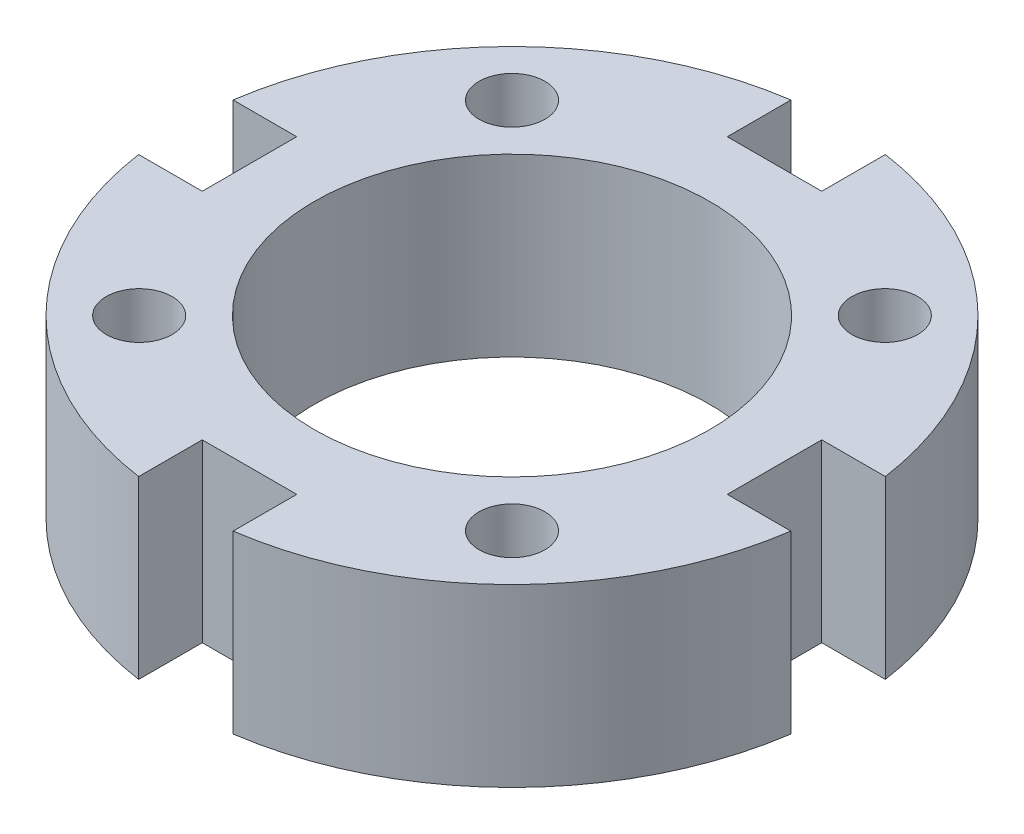
ISO-10303-21;
HEADER;
FILE_DESCRIPTION(('STEP AP214'),'2;1');
FILE_NAME('part.step','',(''),(''),'','','');
FILE_SCHEMA(('AUTOMOTIVE_DESIGN { 1 0 10303 214 1 1 1 1 }'));
ENDSEC;
DATA;
#1=APPLICATION_CONTEXT('core data for automotive mechanical design processes');
#2=APPLICATION_PROTOCOL_DEFINITION('international standard','automotive_design',2000,#1);
#3=PRODUCT_CONTEXT('',#1,'mechanical');
#4=PRODUCT('Part','Part','',(#3));
#5=PRODUCT_RELATED_PRODUCT_CATEGORY('part','',(#4));
#6=PRODUCT_DEFINITION_FORMATION('','',#4);
#7=PRODUCT_DEFINITION_CONTEXT('part definition',#1,'design');
#8=PRODUCT_DEFINITION('design','',#6,#7);
#9=PRODUCT_DEFINITION_SHAPE('','',#8);
#10=(LENGTH_UNIT() NAMED_UNIT(*) SI_UNIT(.MILLI.,.METRE.));
#11=(NAMED_UNIT(*) PLANE_ANGLE_UNIT() SI_UNIT($,.RADIAN.));
#12=(NAMED_UNIT(*) SI_UNIT($,.STERADIAN.) SOLID_ANGLE_UNIT());
#13=UNCERTAINTY_MEASURE_WITH_UNIT(LENGTH_MEASURE(1.E-05),#10,'distance_accuracy_value','');
#14=(GEOMETRIC_REPRESENTATION_CONTEXT(3) GLOBAL_UNCERTAINTY_ASSIGNED_CONTEXT((#13)) GLOBAL_UNIT_ASSIGNED_CONTEXT((#10,
#11,#12)) REPRESENTATION_CONTEXT('',''));
#15=CARTESIAN_POINT('',(0.,0.,0.));
#16=DIRECTION('',(0.,0.,1.));
#17=DIRECTION('',(1.,0.,0.));
#18=AXIS2_PLACEMENT_3D('',#15,#16,#17);
#19=CARTESIAN_POINT('',(0.,4.,0.));
#20=DIRECTION('',(0.,1.,0.));
#21=DIRECTION('',(0.,0.,1.));
#22=AXIS2_PLACEMENT_3D('',#19,#20,#21);
#23=PLANE('',#22);
#24=CARTESIAN_POINT('',(4.24264068711925,4.,-4.24264068711932));
#25=DIRECTION('',(0.,-1.,0.));
#26=DIRECTION('',(-1.,0.,0.));
#27=AXIS2_PLACEMENT_3D('',#24,#25,#26);
#28=CIRCLE('',#27,0.749999999999997);
#29=CARTESIAN_POINT('',(3.49264068711925,4.,-4.24264068711932));
#30=VERTEX_POINT('',#29);
#31=EDGE_CURVE('E382',#30,#30,#28,.T.);
#32=ORIENTED_EDGE('',*,*,#31,.T.);
#33=EDGE_LOOP('',(#32));
#34=FACE_BOUND('',#33,.T.);
#35=CARTESIAN_POINT('',(-4.24264068711931,4.,-4.24264068711926));
#36=DIRECTION('',(0.,-1.,0.));
#37=DIRECTION('',(0.,0.,1.));
#38=AXIS2_PLACEMENT_3D('',#35,#36,#37);
#39=CIRCLE('',#38,0.749999999999997);
#40=CARTESIAN_POINT('',(-4.24264068711931,4.,-3.49264068711927));
#41=VERTEX_POINT('',#40);
#42=EDGE_CURVE('E386',#41,#41,#39,.T.);
#43=ORIENTED_EDGE('',*,*,#42,.T.);
#44=EDGE_LOOP('',(#43));
#45=FACE_BOUND('',#44,.T.);
#46=CARTESIAN_POINT('',(-4.24264068711922,4.,4.24264068711935));
#47=DIRECTION('',(0.,-1.,0.));
#48=DIRECTION('',(1.,0.,0.));
#49=AXIS2_PLACEMENT_3D('',#46,#47,#48);
#50=CIRCLE('',#49,0.749999999999997);
#51=CARTESIAN_POINT('',(-3.49264068711922,4.,4.24264068711934));
#52=VERTEX_POINT('',#51);
#53=EDGE_CURVE('E396',#52,#52,#50,.T.);
#54=ORIENTED_EDGE('',*,*,#53,.T.);
#55=EDGE_LOOP('',(#54));
#56=FACE_BOUND('',#55,.T.);
#57=CARTESIAN_POINT('',(4.24264068711931,4.,4.24264068711926));
#58=DIRECTION('',(0.,-1.,0.));
#59=DIRECTION('',(0.,0.,-1.));
#60=AXIS2_PLACEMENT_3D('',#57,#58,#59);
#61=CIRCLE('',#60,0.749999999999997);
#62=CARTESIAN_POINT('',(4.24264068711931,4.,3.49264068711927));
#63=VERTEX_POINT('',#62);
#64=EDGE_CURVE('E216',#63,#63,#61,.T.);
#65=ORIENTED_EDGE('',*,*,#64,.T.);
#66=EDGE_LOOP('',(#65));
#67=FACE_BOUND('',#66,.T.);
#68=CARTESIAN_POINT('',(0.,4.,0.));
#69=DIRECTION('',(0.,1.,0.));
#70=DIRECTION('',(0.,0.,1.));
#71=AXIS2_PLACEMENT_3D('',#68,#69,#70);
#72=CIRCLE('',#71,4.5);
#73=CARTESIAN_POINT('',(0.,4.,4.5));
#74=VERTEX_POINT('',#73);
#75=EDGE_CURVE('E246',#74,#74,#72,.T.);
#76=ORIENTED_EDGE('',*,*,#75,.F.);
#77=EDGE_LOOP('',(#76));
#78=FACE_BOUND('',#77,.T.);
#79=CARTESIAN_POINT('',(0.,4.,0.));
#80=DIRECTION('',(0.,1.,0.));
#81=DIRECTION('',(0.,0.,1.));
#82=AXIS2_PLACEMENT_3D('',#79,#80,#81);
#83=CIRCLE('',#82,7.5);
#84=CARTESIAN_POINT('',(1.075,4.,7.42255852115697));
#85=VERTEX_POINT('',#84);
#86=CARTESIAN_POINT('',(7.42255852115698,4.,1.07499999999997));
#87=VERTEX_POINT('',#86);
#88=EDGE_CURVE('E252',#85,#87,#83,.T.);
#89=ORIENTED_EDGE('',*,*,#88,.T.);
#90=DIRECTION('',(1.,0.,0.));
#91=VECTOR('',#90,1.);
#92=CARTESIAN_POINT('',(5.97499999997551,4.,1.07499999999998));
#93=LINE('',#92,#91);
#94=CARTESIAN_POINT('',(5.97499999997551,4.,1.07499999999998));
#95=VERTEX_POINT('',#94);
#96=EDGE_CURVE('E173',#95,#87,#93,.T.);
#97=ORIENTED_EDGE('',*,*,#96,.F.);
#98=DIRECTION('',(0.,0.,-1.));
#99=VECTOR('',#98,1.);
#100=CARTESIAN_POINT('',(5.97499999997551,4.,1.07499999999998));
#101=LINE('',#100,#99);
#102=CARTESIAN_POINT('',(5.9749999999755,4.,-1.07500000000002));
#103=VERTEX_POINT('',#102);
#104=EDGE_CURVE('E172',#95,#103,#101,.T.);
#105=ORIENTED_EDGE('',*,*,#104,.T.);
#106=DIRECTION('',(1.,0.,0.));
#107=VECTOR('',#106,1.);
#108=CARTESIAN_POINT('',(5.9749999999755,4.,-1.07500000000002));
#109=LINE('',#108,#107);
#110=CARTESIAN_POINT('',(7.42255852115697,4.,-1.07500000000003));
#111=VERTEX_POINT('',#110);
#112=EDGE_CURVE('E164',#103,#111,#109,.T.);
#113=ORIENTED_EDGE('',*,*,#112,.T.);
#114=CARTESIAN_POINT('',(1.075,4.,-7.42255852115697));
#115=VERTEX_POINT('',#114);
#116=EDGE_CURVE('E256',#111,#115,#83,.T.);
#117=ORIENTED_EDGE('',*,*,#116,.T.);
#118=DIRECTION('',(0.,0.,-1.));
#119=VECTOR('',#118,1.);
#120=CARTESIAN_POINT('',(1.075,4.,-5.97499999997551));
#121=LINE('',#120,#119);
#122=CARTESIAN_POINT('',(1.075,4.,-5.97499999997551));
#123=VERTEX_POINT('',#122);
#124=EDGE_CURVE('E191',#123,#115,#121,.T.);
#125=ORIENTED_EDGE('',*,*,#124,.F.);
#126=DIRECTION('',(-1.,0.,0.));
#127=VECTOR('',#126,1.);
#128=CARTESIAN_POINT('',(1.075,4.,-5.97499999997551));
#129=LINE('',#128,#127);
#130=CARTESIAN_POINT('',(-1.075,4.,-5.97499999997551));
#131=VERTEX_POINT('',#130);
#132=EDGE_CURVE('E201',#123,#131,#129,.T.);
#133=ORIENTED_EDGE('',*,*,#132,.T.);
#134=DIRECTION('',(0.,0.,-1.));
#135=VECTOR('',#134,1.);
#136=CARTESIAN_POINT('',(-1.075,4.,-5.97499999997551));
#137=LINE('',#136,#135);
#138=CARTESIAN_POINT('',(-1.075,4.,-7.42255852115697));
#139=VERTEX_POINT('',#138);
#140=EDGE_CURVE('E188',#131,#139,#137,.T.);
#141=ORIENTED_EDGE('',*,*,#140,.T.);
#142=CARTESIAN_POINT('',(-7.42255852115698,4.,-1.07499999999992));
#143=VERTEX_POINT('',#142);
#144=EDGE_CURVE('E409',#139,#143,#83,.T.);
#145=ORIENTED_EDGE('',*,*,#144,.T.);
#146=DIRECTION('',(-1.,0.,0.));
#147=VECTOR('',#146,1.);
#148=CARTESIAN_POINT('',(-5.97499999997552,4.,-1.07499999999994));
#149=LINE('',#148,#147);
#150=CARTESIAN_POINT('',(-5.97499999997552,4.,-1.07499999999994));
#151=VERTEX_POINT('',#150);
#152=EDGE_CURVE('E211',#151,#143,#149,.T.);
#153=ORIENTED_EDGE('',*,*,#152,.F.);
#154=DIRECTION('',(0.,0.,1.));
#155=VECTOR('',#154,1.);
#156=CARTESIAN_POINT('',(-5.97499999997552,4.,-1.07499999999994));
#157=LINE('',#156,#155);
#158=CARTESIAN_POINT('',(-5.9749999999755,4.,1.07500000000006));
#159=VERTEX_POINT('',#158);
#160=EDGE_CURVE('E196',#151,#159,#157,.T.);
#161=ORIENTED_EDGE('',*,*,#160,.T.);
#162=DIRECTION('',(-1.,0.,0.));
#163=VECTOR('',#162,1.);
#164=CARTESIAN_POINT('',(-5.9749999999755,4.,1.07500000000006));
#165=LINE('',#164,#163);
#166=CARTESIAN_POINT('',(-7.42255852115696,4.,1.07500000000008));
#167=VERTEX_POINT('',#166);
#168=EDGE_CURVE('E208',#159,#167,#165,.T.);
#169=ORIENTED_EDGE('',*,*,#168,.T.);
#170=CARTESIAN_POINT('',(-1.075,4.,7.42255852115697));
#171=VERTEX_POINT('',#170);
#172=EDGE_CURVE('E257',#167,#171,#83,.T.);
#173=ORIENTED_EDGE('',*,*,#172,.T.);
#174=DIRECTION('',(0.,0.,1.));
#175=VECTOR('',#174,1.);
#176=CARTESIAN_POINT('',(-1.075,4.,5.97499999997551));
#177=LINE('',#176,#175);
#178=CARTESIAN_POINT('',(-1.075,4.,5.97499999997551));
#179=VERTEX_POINT('',#178);
#180=EDGE_CURVE('E230',#179,#171,#177,.T.);
#181=ORIENTED_EDGE('',*,*,#180,.F.);
#182=DIRECTION('',(1.,0.,0.));
#183=VECTOR('',#182,1.);
#184=CARTESIAN_POINT('',(-1.075,4.,5.97499999997551));
#185=LINE('',#184,#183);
#186=CARTESIAN_POINT('',(1.075,4.,5.97499999997551));
#187=VERTEX_POINT('',#186);
#188=EDGE_CURVE('E241',#179,#187,#185,.T.);
#189=ORIENTED_EDGE('',*,*,#188,.T.);
#190=DIRECTION('',(0.,0.,1.));
#191=VECTOR('',#190,1.);
#192=CARTESIAN_POINT('',(1.075,4.,5.97499999997551));
#193=LINE('',#192,#191);
#194=EDGE_CURVE('E227',#187,#85,#193,.T.);
#195=ORIENTED_EDGE('',*,*,#194,.T.);
#196=EDGE_LOOP('',(#89,#97,#105,#113,#117,#125,#133,#141,#145,#153,#161,#169,#173,#181,#189,#195));
#197=FACE_BOUND('',#196,.T.);
#198=ADVANCED_FACE('F40',(#34,#45,#56,#67,#78,#197),#23,.T.);
#199=CARTESIAN_POINT('',(0.,0.,0.));
#200=DIRECTION('',(0.,1.,0.));
#201=DIRECTION('',(0.,0.,1.));
#202=AXIS2_PLACEMENT_3D('',#199,#200,#201);
#203=PLANE('',#202);
#204=CARTESIAN_POINT('',(4.24264068711925,0.,-4.24264068711932));
#205=DIRECTION('',(0.,-1.,0.));
#206=DIRECTION('',(-1.,0.,0.));
#207=AXIS2_PLACEMENT_3D('',#204,#205,#206);
#208=CIRCLE('',#207,0.749999999999997);
#209=CARTESIAN_POINT('',(3.49264068711925,0.,-4.24264068711932));
#210=VERTEX_POINT('',#209);
#211=EDGE_CURVE('E385',#210,#210,#208,.T.);
#212=ORIENTED_EDGE('',*,*,#211,.F.);
#213=EDGE_LOOP('',(#212));
#214=FACE_BOUND('',#213,.T.);
#215=CARTESIAN_POINT('',(-4.24264068711931,0.,-4.24264068711926));
#216=DIRECTION('',(0.,-1.,0.));
#217=DIRECTION('',(0.,0.,1.));
#218=AXIS2_PLACEMENT_3D('',#215,#216,#217);
#219=CIRCLE('',#218,0.749999999999997);
#220=CARTESIAN_POINT('',(-4.24264068711931,0.,-3.49264068711927));
#221=VERTEX_POINT('',#220);
#222=EDGE_CURVE('E391',#221,#221,#219,.T.);
#223=ORIENTED_EDGE('',*,*,#222,.F.);
#224=EDGE_LOOP('',(#223));
#225=FACE_BOUND('',#224,.T.);
#226=CARTESIAN_POINT('',(-4.24264068711922,0.,4.24264068711935));
#227=DIRECTION('',(0.,-1.,0.));
#228=DIRECTION('',(1.,0.,0.));
#229=AXIS2_PLACEMENT_3D('',#226,#227,#228);
#230=CIRCLE('',#229,0.749999999999997);
#231=CARTESIAN_POINT('',(-3.49264068711922,0.,4.24264068711934));
#232=VERTEX_POINT('',#231);
#233=EDGE_CURVE('E399',#232,#232,#230,.T.);
#234=ORIENTED_EDGE('',*,*,#233,.F.);
#235=EDGE_LOOP('',(#234));
#236=FACE_BOUND('',#235,.T.);
#237=CARTESIAN_POINT('',(4.24264068711931,0.,4.24264068711926));
#238=DIRECTION('',(0.,-1.,0.));
#239=DIRECTION('',(0.,0.,-1.));
#240=AXIS2_PLACEMENT_3D('',#237,#238,#239);
#241=CIRCLE('',#240,0.749999999999997);
#242=CARTESIAN_POINT('',(4.24264068711931,0.,3.49264068711927));
#243=VERTEX_POINT('',#242);
#244=EDGE_CURVE('E388',#243,#243,#241,.T.);
#245=ORIENTED_EDGE('',*,*,#244,.F.);
#246=EDGE_LOOP('',(#245));
#247=FACE_BOUND('',#246,.T.);
#248=CARTESIAN_POINT('',(0.,0.,0.));
#249=DIRECTION('',(0.,1.,0.));
#250=DIRECTION('',(0.,0.,1.));
#251=AXIS2_PLACEMENT_3D('',#248,#249,#250);
#252=CIRCLE('',#251,4.5);
#253=CARTESIAN_POINT('',(0.,0.,4.5));
#254=VERTEX_POINT('',#253);
#255=EDGE_CURVE('E244',#254,#254,#252,.T.);
#256=ORIENTED_EDGE('',*,*,#255,.T.);
#257=EDGE_LOOP('',(#256));
#258=FACE_BOUND('',#257,.T.);
#259=DIRECTION('',(-1.,0.,0.));
#260=VECTOR('',#259,1.);
#261=CARTESIAN_POINT('',(7.49999999997551,0.,1.07499999999997));
#262=LINE('',#261,#260);
#263=CARTESIAN_POINT('',(7.42255852115698,0.,1.07499999999997));
#264=VERTEX_POINT('',#263);
#265=CARTESIAN_POINT('',(5.97499999997551,0.,1.07499999999998));
#266=VERTEX_POINT('',#265);
#267=EDGE_CURVE('E154',#264,#266,#262,.T.);
#268=ORIENTED_EDGE('',*,*,#267,.F.);
#269=CARTESIAN_POINT('',(0.,0.,0.));
#270=DIRECTION('',(0.,1.,0.));
#271=DIRECTION('',(0.,0.,1.));
#272=AXIS2_PLACEMENT_3D('',#269,#270,#271);
#273=CIRCLE('',#272,7.5);
#274=CARTESIAN_POINT('',(1.075,0.,7.42255852115697));
#275=VERTEX_POINT('',#274);
#276=EDGE_CURVE('E258',#275,#264,#273,.T.);
#277=ORIENTED_EDGE('',*,*,#276,.F.);
#278=DIRECTION('',(0.,0.,-1.));
#279=VECTOR('',#278,1.);
#280=CARTESIAN_POINT('',(1.075,0.,7.49999999997551));
#281=LINE('',#280,#279);
#282=CARTESIAN_POINT('',(1.075,0.,5.97499999997551));
#283=VERTEX_POINT('',#282);
#284=EDGE_CURVE('E180',#275,#283,#281,.T.);
#285=ORIENTED_EDGE('',*,*,#284,.T.);
#286=DIRECTION('',(1.,0.,0.));
#287=VECTOR('',#286,1.);
#288=CARTESIAN_POINT('',(-1.075,0.,5.97499999997551));
#289=LINE('',#288,#287);
#290=CARTESIAN_POINT('',(-1.075,0.,5.97499999997551));
#291=VERTEX_POINT('',#290);
#292=EDGE_CURVE('E233',#291,#283,#289,.T.);
#293=ORIENTED_EDGE('',*,*,#292,.F.);
#294=DIRECTION('',(0.,0.,-1.));
#295=VECTOR('',#294,1.);
#296=CARTESIAN_POINT('',(-1.075,0.,7.49999999997551));
#297=LINE('',#296,#295);
#298=CARTESIAN_POINT('',(-1.075,0.,7.42255852115697));
#299=VERTEX_POINT('',#298);
#300=EDGE_CURVE('E224',#299,#291,#297,.T.);
#301=ORIENTED_EDGE('',*,*,#300,.F.);
#302=CARTESIAN_POINT('',(-7.42255852115696,0.,1.07500000000008));
#303=VERTEX_POINT('',#302);
#304=EDGE_CURVE('E249',#303,#299,#273,.T.);
#305=ORIENTED_EDGE('',*,*,#304,.F.);
#306=DIRECTION('',(1.,0.,0.));
#307=VECTOR('',#306,1.);
#308=CARTESIAN_POINT('',(-7.4999999999755,0.,1.07500000000008));
#309=LINE('',#308,#307);
#310=CARTESIAN_POINT('',(-5.9749999999755,0.,1.07500000000006));
#311=VERTEX_POINT('',#310);
#312=EDGE_CURVE('E55',#303,#311,#309,.T.);
#313=ORIENTED_EDGE('',*,*,#312,.T.);
#314=DIRECTION('',(0.,0.,1.));
#315=VECTOR('',#314,1.);
#316=CARTESIAN_POINT('',(-5.97499999997552,0.,-1.07499999999994));
#317=LINE('',#316,#315);
#318=CARTESIAN_POINT('',(-5.97499999997552,0.,-1.07499999999994));
#319=VERTEX_POINT('',#318);
#320=EDGE_CURVE('E213',#319,#311,#317,.T.);
#321=ORIENTED_EDGE('',*,*,#320,.F.);
#322=DIRECTION('',(1.,0.,0.));
#323=VECTOR('',#322,1.);
#324=CARTESIAN_POINT('',(-7.49999999997552,0.,-1.07499999999992));
#325=LINE('',#324,#323);
#326=CARTESIAN_POINT('',(-7.42255852115698,0.,-1.07499999999992));
#327=VERTEX_POINT('',#326);
#328=EDGE_CURVE('E205',#327,#319,#325,.T.);
#329=ORIENTED_EDGE('',*,*,#328,.F.);
#330=CARTESIAN_POINT('',(-1.075,0.,-7.42255852115697));
#331=VERTEX_POINT('',#330);
#332=EDGE_CURVE('E284',#331,#327,#273,.T.);
#333=ORIENTED_EDGE('',*,*,#332,.F.);
#334=DIRECTION('',(0.,0.,1.));
#335=VECTOR('',#334,1.);
#336=CARTESIAN_POINT('',(-1.075,0.,-7.49999999997551));
#337=LINE('',#336,#335);
#338=CARTESIAN_POINT('',(-1.075,0.,-5.97499999997551));
#339=VERTEX_POINT('',#338);
#340=EDGE_CURVE('E63',#331,#339,#337,.T.);
#341=ORIENTED_EDGE('',*,*,#340,.T.);
#342=DIRECTION('',(-1.,0.,0.));
#343=VECTOR('',#342,1.);
#344=CARTESIAN_POINT('',(1.075,0.,-5.97499999997551));
#345=LINE('',#344,#343);
#346=CARTESIAN_POINT('',(1.075,0.,-5.97499999997551));
#347=VERTEX_POINT('',#346);
#348=EDGE_CURVE('E193',#347,#339,#345,.T.);
#349=ORIENTED_EDGE('',*,*,#348,.F.);
#350=DIRECTION('',(0.,0.,1.));
#351=VECTOR('',#350,1.);
#352=CARTESIAN_POINT('',(1.075,0.,-7.49999999997551));
#353=LINE('',#352,#351);
#354=CARTESIAN_POINT('',(1.075,0.,-7.42255852115697));
#355=VERTEX_POINT('',#354);
#356=EDGE_CURVE('E185',#355,#347,#353,.T.);
#357=ORIENTED_EDGE('',*,*,#356,.F.);
#358=CARTESIAN_POINT('',(7.42255852115697,0.,-1.07500000000003));
#359=VERTEX_POINT('',#358);
#360=EDGE_CURVE('E260',#359,#355,#273,.T.);
#361=ORIENTED_EDGE('',*,*,#360,.F.);
#362=DIRECTION('',(-1.,0.,0.));
#363=VECTOR('',#362,1.);
#364=CARTESIAN_POINT('',(7.4999999999755,0.,-1.07500000000003));
#365=LINE('',#364,#363);
#366=CARTESIAN_POINT('',(5.9749999999755,0.,-1.07500000000002));
#367=VERTEX_POINT('',#366);
#368=EDGE_CURVE('E178',#359,#367,#365,.T.);
#369=ORIENTED_EDGE('',*,*,#368,.T.);
#370=DIRECTION('',(0.,0.,-1.));
#371=VECTOR('',#370,1.);
#372=CARTESIAN_POINT('',(5.97499999997551,0.,1.07499999999998));
#373=LINE('',#372,#371);
#374=EDGE_CURVE('E169',#266,#367,#373,.T.);
#375=ORIENTED_EDGE('',*,*,#374,.F.);
#376=EDGE_LOOP('',(#268,#277,#285,#293,#301,#305,#313,#321,#329,#333,#341,#349,#357,#361,#369,#375));
#377=FACE_BOUND('',#376,.T.);
#378=ADVANCED_FACE('F176',(#214,#225,#236,#247,#258,#377),#203,.F.);
#379=CARTESIAN_POINT('',(0.,4.,0.));
#380=DIRECTION('',(0.,-1.,0.));
#381=DIRECTION('',(0.,0.,-1.));
#382=AXIS2_PLACEMENT_3D('',#379,#380,#381);
#383=CYLINDRICAL_SURFACE('',#382,7.5);
#384=DIRECTION('',(0.,-1.,0.));
#385=VECTOR('',#384,1.);
#386=CARTESIAN_POINT('',(7.42255852115698,4.,1.07499999999997));
#387=LINE('',#386,#385);
#388=EDGE_CURVE('E12',#87,#264,#387,.T.);
#389=ORIENTED_EDGE('',*,*,#388,.F.);
#390=ORIENTED_EDGE('',*,*,#88,.F.);
#391=DIRECTION('',(0.,-1.,0.));
#392=VECTOR('',#391,1.);
#393=CARTESIAN_POINT('',(1.075,4.,7.42255852115697));
#394=LINE('',#393,#392);
#395=EDGE_CURVE('E255',#85,#275,#394,.T.);
#396=ORIENTED_EDGE('',*,*,#395,.T.);
#397=ORIENTED_EDGE('',*,*,#276,.T.);
#398=EDGE_LOOP('',(#389,#390,#396,#397));
#399=FACE_BOUND('',#398,.T.);
#400=ADVANCED_FACE('F307',(#399),#383,.T.);
#401=ORIENTED_EDGE('',*,*,#116,.F.);
#402=DIRECTION('',(0.,-1.,0.));
#403=VECTOR('',#402,1.);
#404=CARTESIAN_POINT('',(7.42255852115697,4.,-1.07500000000003));
#405=LINE('',#404,#403);
#406=EDGE_CURVE('E48',#111,#359,#405,.T.);
#407=ORIENTED_EDGE('',*,*,#406,.T.);
#408=ORIENTED_EDGE('',*,*,#360,.T.);
#409=DIRECTION('',(0.,-1.,0.));
#410=VECTOR('',#409,1.);
#411=CARTESIAN_POINT('',(1.075,4.,-7.42255852115697));
#412=LINE('',#411,#410);
#413=EDGE_CURVE('E272',#115,#355,#412,.T.);
#414=ORIENTED_EDGE('',*,*,#413,.F.);
#415=EDGE_LOOP('',(#401,#407,#408,#414));
#416=FACE_BOUND('',#415,.T.);
#417=ADVANCED_FACE('F277',(#416),#383,.T.);
#418=ORIENTED_EDGE('',*,*,#144,.F.);
#419=DIRECTION('',(0.,-1.,0.));
#420=VECTOR('',#419,1.);
#421=CARTESIAN_POINT('',(-1.075,4.,-7.42255852115697));
#422=LINE('',#421,#420);
#423=EDGE_CURVE('E270',#139,#331,#422,.T.);
#424=ORIENTED_EDGE('',*,*,#423,.T.);
#425=ORIENTED_EDGE('',*,*,#332,.T.);
#426=DIRECTION('',(0.,-1.,0.));
#427=VECTOR('',#426,1.);
#428=CARTESIAN_POINT('',(-7.42255852115698,4.,-1.07499999999992));
#429=LINE('',#428,#427);
#430=EDGE_CURVE('E268',#143,#327,#429,.T.);
#431=ORIENTED_EDGE('',*,*,#430,.F.);
#432=EDGE_LOOP('',(#418,#424,#425,#431));
#433=FACE_BOUND('',#432,.T.);
#434=ADVANCED_FACE('F313',(#433),#383,.T.);
#435=ORIENTED_EDGE('',*,*,#172,.F.);
#436=DIRECTION('',(0.,-1.,0.));
#437=VECTOR('',#436,1.);
#438=CARTESIAN_POINT('',(-7.42255852115696,4.,1.07500000000008));
#439=LINE('',#438,#437);
#440=EDGE_CURVE('E266',#167,#303,#439,.T.);
#441=ORIENTED_EDGE('',*,*,#440,.T.);
#442=ORIENTED_EDGE('',*,*,#304,.T.);
#443=DIRECTION('',(0.,-1.,0.));
#444=VECTOR('',#443,1.);
#445=CARTESIAN_POINT('',(-1.075,4.,7.42255852115697));
#446=LINE('',#445,#444);
#447=EDGE_CURVE('E263',#171,#299,#446,.T.);
#448=ORIENTED_EDGE('',*,*,#447,.F.);
#449=EDGE_LOOP('',(#435,#441,#442,#448));
#450=FACE_BOUND('',#449,.T.);
#451=ADVANCED_FACE('F42',(#450),#383,.T.);
#452=CARTESIAN_POINT('',(0.,4.,0.));
#453=DIRECTION('',(0.,-1.,0.));
#454=DIRECTION('',(0.,0.,-1.));
#455=AXIS2_PLACEMENT_3D('',#452,#453,#454);
#456=CYLINDRICAL_SURFACE('',#455,4.5);
#457=ORIENTED_EDGE('',*,*,#75,.T.);
#458=EDGE_LOOP('',(#457));
#459=FACE_BOUND('',#458,.T.);
#460=ORIENTED_EDGE('',*,*,#255,.F.);
#461=EDGE_LOOP('',(#460));
#462=FACE_BOUND('',#461,.T.);
#463=ADVANCED_FACE('F316',(#459,#462),#456,.F.);
#464=CARTESIAN_POINT('',(-1.075,0.,0.));
#465=DIRECTION('',(1.,0.,0.));
#466=DIRECTION('',(0.,0.,-1.));
#467=AXIS2_PLACEMENT_3D('',#464,#465,#466);
#468=PLANE('',#467);
#469=ORIENTED_EDGE('',*,*,#447,.T.);
#470=ORIENTED_EDGE('',*,*,#300,.T.);
#471=DIRECTION('',(0.,1.,0.));
#472=VECTOR('',#471,1.);
#473=CARTESIAN_POINT('',(-1.075,0.,5.97499999997551));
#474=LINE('',#473,#472);
#475=EDGE_CURVE('E226',#291,#179,#474,.T.);
#476=ORIENTED_EDGE('',*,*,#475,.T.);
#477=ORIENTED_EDGE('',*,*,#180,.T.);
#478=EDGE_LOOP('',(#469,#470,#476,#477));
#479=FACE_BOUND('',#478,.T.);
#480=ADVANCED_FACE('F295',(#479),#468,.T.);
#481=CARTESIAN_POINT('',(1.075,0.,0.));
#482=DIRECTION('',(1.,0.,0.));
#483=DIRECTION('',(0.,0.,-1.));
#484=AXIS2_PLACEMENT_3D('',#481,#482,#483);
#485=PLANE('',#484);
#486=ORIENTED_EDGE('',*,*,#194,.F.);
#487=DIRECTION('',(0.,1.,0.));
#488=VECTOR('',#487,1.);
#489=CARTESIAN_POINT('',(1.075,0.,5.97499999997551));
#490=LINE('',#489,#488);
#491=EDGE_CURVE('E236',#283,#187,#490,.T.);
#492=ORIENTED_EDGE('',*,*,#491,.F.);
#493=ORIENTED_EDGE('',*,*,#284,.F.);
#494=ORIENTED_EDGE('',*,*,#395,.F.);
#495=EDGE_LOOP('',(#486,#492,#493,#494));
#496=FACE_BOUND('',#495,.T.);
#497=ADVANCED_FACE('F303',(#496),#485,.F.);
#498=CARTESIAN_POINT('',(-1.075,0.,5.97499999997551));
#499=DIRECTION('',(0.,0.,-1.));
#500=DIRECTION('',(-1.,0.,0.));
#501=AXIS2_PLACEMENT_3D('',#498,#499,#500);
#502=PLANE('',#501);
#503=ORIENTED_EDGE('',*,*,#491,.T.);
#504=ORIENTED_EDGE('',*,*,#188,.F.);
#505=ORIENTED_EDGE('',*,*,#475,.F.);
#506=ORIENTED_EDGE('',*,*,#292,.T.);
#507=EDGE_LOOP('',(#503,#504,#505,#506));
#508=FACE_BOUND('',#507,.T.);
#509=ADVANCED_FACE('F301',(#508),#502,.F.);
#510=CARTESIAN_POINT('',(0.,0.,-1.075));
#511=DIRECTION('',(0.,0.,1.));
#512=DIRECTION('',(1.,0.,0.));
#513=AXIS2_PLACEMENT_3D('',#510,#511,#512);
#514=PLANE('',#513);
#515=ORIENTED_EDGE('',*,*,#430,.T.);
#516=ORIENTED_EDGE('',*,*,#328,.T.);
#517=DIRECTION('',(0.,1.,0.));
#518=VECTOR('',#517,1.);
#519=CARTESIAN_POINT('',(-5.97499999997552,0.,-1.07499999999994));
#520=LINE('',#519,#518);
#521=EDGE_CURVE('E207',#319,#151,#520,.T.);
#522=ORIENTED_EDGE('',*,*,#521,.T.);
#523=ORIENTED_EDGE('',*,*,#152,.T.);
#524=EDGE_LOOP('',(#515,#516,#522,#523));
#525=FACE_BOUND('',#524,.T.);
#526=ADVANCED_FACE('F330',(#525),#514,.T.);
#527=CARTESIAN_POINT('',(0.,0.,1.075));
#528=DIRECTION('',(0.,0.,1.));
#529=DIRECTION('',(1.,0.,0.));
#530=AXIS2_PLACEMENT_3D('',#527,#528,#529);
#531=PLANE('',#530);
#532=ORIENTED_EDGE('',*,*,#168,.F.);
#533=DIRECTION('',(0.,1.,0.));
#534=VECTOR('',#533,1.);
#535=CARTESIAN_POINT('',(-5.9749999999755,0.,1.07500000000006));
#536=LINE('',#535,#534);
#537=EDGE_CURVE('E215',#311,#159,#536,.T.);
#538=ORIENTED_EDGE('',*,*,#537,.F.);
#539=ORIENTED_EDGE('',*,*,#312,.F.);
#540=ORIENTED_EDGE('',*,*,#440,.F.);
#541=EDGE_LOOP('',(#532,#538,#539,#540));
#542=FACE_BOUND('',#541,.T.);
#543=ADVANCED_FACE('F339',(#542),#531,.F.);
#544=CARTESIAN_POINT('',(-5.97499999997552,0.,-1.07499999999994));
#545=DIRECTION('',(1.,0.,0.));
#546=DIRECTION('',(0.,0.,-1.));
#547=AXIS2_PLACEMENT_3D('',#544,#545,#546);
#548=PLANE('',#547);
#549=ORIENTED_EDGE('',*,*,#537,.T.);
#550=ORIENTED_EDGE('',*,*,#160,.F.);
#551=ORIENTED_EDGE('',*,*,#521,.F.);
#552=ORIENTED_EDGE('',*,*,#320,.T.);
#553=EDGE_LOOP('',(#549,#550,#551,#552));
#554=FACE_BOUND('',#553,.T.);
#555=ADVANCED_FACE('F335',(#554),#548,.F.);
#556=CARTESIAN_POINT('',(1.075,0.,0.));
#557=DIRECTION('',(-1.,0.,0.));
#558=DIRECTION('',(0.,0.,1.));
#559=AXIS2_PLACEMENT_3D('',#556,#557,#558);
#560=PLANE('',#559);
#561=ORIENTED_EDGE('',*,*,#413,.T.);
#562=ORIENTED_EDGE('',*,*,#356,.T.);
#563=DIRECTION('',(0.,1.,0.));
#564=VECTOR('',#563,1.);
#565=CARTESIAN_POINT('',(1.075,0.,-5.97499999997551));
#566=LINE('',#565,#564);
#567=EDGE_CURVE('E187',#347,#123,#566,.T.);
#568=ORIENTED_EDGE('',*,*,#567,.T.);
#569=ORIENTED_EDGE('',*,*,#124,.T.);
#570=EDGE_LOOP('',(#561,#562,#568,#569));
#571=FACE_BOUND('',#570,.T.);
#572=ADVANCED_FACE('F338',(#571),#560,.T.);
#573=CARTESIAN_POINT('',(-1.075,0.,0.));
#574=DIRECTION('',(-1.,0.,0.));
#575=DIRECTION('',(0.,0.,1.));
#576=AXIS2_PLACEMENT_3D('',#573,#574,#575);
#577=PLANE('',#576);
#578=ORIENTED_EDGE('',*,*,#140,.F.);
#579=DIRECTION('',(0.,1.,0.));
#580=VECTOR('',#579,1.);
#581=CARTESIAN_POINT('',(-1.075,0.,-5.97499999997551));
#582=LINE('',#581,#580);
#583=EDGE_CURVE('E195',#339,#131,#582,.T.);
#584=ORIENTED_EDGE('',*,*,#583,.F.);
#585=ORIENTED_EDGE('',*,*,#340,.F.);
#586=ORIENTED_EDGE('',*,*,#423,.F.);
#587=EDGE_LOOP('',(#578,#584,#585,#586));
#588=FACE_BOUND('',#587,.T.);
#589=ADVANCED_FACE('F349',(#588),#577,.F.);
#590=CARTESIAN_POINT('',(1.075,0.,-5.97499999997551));
#591=DIRECTION('',(0.,0.,1.));
#592=DIRECTION('',(1.,0.,0.));
#593=AXIS2_PLACEMENT_3D('',#590,#591,#592);
#594=PLANE('',#593);
#595=ORIENTED_EDGE('',*,*,#583,.T.);
#596=ORIENTED_EDGE('',*,*,#132,.F.);
#597=ORIENTED_EDGE('',*,*,#567,.F.);
#598=ORIENTED_EDGE('',*,*,#348,.T.);
#599=EDGE_LOOP('',(#595,#596,#597,#598));
#600=FACE_BOUND('',#599,.T.);
#601=ADVANCED_FACE('F346',(#600),#594,.F.);
#602=CARTESIAN_POINT('',(0.,0.,1.075));
#603=DIRECTION('',(0.,0.,-1.));
#604=DIRECTION('',(-1.,0.,0.));
#605=AXIS2_PLACEMENT_3D('',#602,#603,#604);
#606=PLANE('',#605);
#607=ORIENTED_EDGE('',*,*,#388,.T.);
#608=ORIENTED_EDGE('',*,*,#267,.T.);
#609=DIRECTION('',(0.,1.,0.));
#610=VECTOR('',#609,1.);
#611=CARTESIAN_POINT('',(5.97499999997551,0.,1.07499999999998));
#612=LINE('',#611,#610);
#613=EDGE_CURVE('E157',#266,#95,#612,.T.);
#614=ORIENTED_EDGE('',*,*,#613,.T.);
#615=ORIENTED_EDGE('',*,*,#96,.T.);
#616=EDGE_LOOP('',(#607,#608,#614,#615));
#617=FACE_BOUND('',#616,.T.);
#618=ADVANCED_FACE('F156',(#617),#606,.T.);
#619=CARTESIAN_POINT('',(0.,0.,-1.075));
#620=DIRECTION('',(0.,0.,-1.));
#621=DIRECTION('',(-1.,0.,0.));
#622=AXIS2_PLACEMENT_3D('',#619,#620,#621);
#623=PLANE('',#622);
#624=ORIENTED_EDGE('',*,*,#112,.F.);
#625=DIRECTION('',(0.,1.,0.));
#626=VECTOR('',#625,1.);
#627=CARTESIAN_POINT('',(5.9749999999755,0.,-1.07500000000002));
#628=LINE('',#627,#626);
#629=EDGE_CURVE('E407',#367,#103,#628,.T.);
#630=ORIENTED_EDGE('',*,*,#629,.F.);
#631=ORIENTED_EDGE('',*,*,#368,.F.);
#632=ORIENTED_EDGE('',*,*,#406,.F.);
#633=EDGE_LOOP('',(#624,#630,#631,#632));
#634=FACE_BOUND('',#633,.T.);
#635=ADVANCED_FACE('F359',(#634),#623,.F.);
#636=CARTESIAN_POINT('',(5.97499999997551,0.,1.07499999999998));
#637=DIRECTION('',(-1.,0.,0.));
#638=DIRECTION('',(0.,0.,1.));
#639=AXIS2_PLACEMENT_3D('',#636,#637,#638);
#640=PLANE('',#639);
#641=ORIENTED_EDGE('',*,*,#629,.T.);
#642=ORIENTED_EDGE('',*,*,#104,.F.);
#643=ORIENTED_EDGE('',*,*,#613,.F.);
#644=ORIENTED_EDGE('',*,*,#374,.T.);
#645=EDGE_LOOP('',(#641,#642,#643,#644));
#646=FACE_BOUND('',#645,.T.);
#647=ADVANCED_FACE('F168',(#646),#640,.F.);
#648=CARTESIAN_POINT('',(4.24264068711931,4.,4.24264068711926));
#649=DIRECTION('',(0.,-1.,0.));
#650=DIRECTION('',(0.,0.,-1.));
#651=AXIS2_PLACEMENT_3D('',#648,#649,#650);
#652=CYLINDRICAL_SURFACE('',#651,0.749999999999997);
#653=ORIENTED_EDGE('',*,*,#64,.F.);
#654=EDGE_LOOP('',(#653));
#655=FACE_BOUND('',#654,.T.);
#656=ORIENTED_EDGE('',*,*,#244,.T.);
#657=EDGE_LOOP('',(#656));
#658=FACE_BOUND('',#657,.T.);
#659=ADVANCED_FACE('F358',(#655,#658),#652,.F.);
#660=CARTESIAN_POINT('',(-4.24264068711922,4.,4.24264068711935));
#661=DIRECTION('',(0.,-1.,0.));
#662=DIRECTION('',(0.,0.,-1.));
#663=AXIS2_PLACEMENT_3D('',#660,#661,#662);
#664=CYLINDRICAL_SURFACE('',#663,0.749999999999997);
#665=ORIENTED_EDGE('',*,*,#53,.F.);
#666=EDGE_LOOP('',(#665));
#667=FACE_BOUND('',#666,.T.);
#668=ORIENTED_EDGE('',*,*,#233,.T.);
#669=EDGE_LOOP('',(#668));
#670=FACE_BOUND('',#669,.T.);
#671=ADVANCED_FACE('F366',(#667,#670),#664,.F.);
#672=CARTESIAN_POINT('',(-4.24264068711931,4.,-4.24264068711926));
#673=DIRECTION('',(0.,-1.,0.));
#674=DIRECTION('',(0.,0.,-1.));
#675=AXIS2_PLACEMENT_3D('',#672,#673,#674);
#676=CYLINDRICAL_SURFACE('',#675,0.749999999999997);
#677=ORIENTED_EDGE('',*,*,#42,.F.);
#678=EDGE_LOOP('',(#677));
#679=FACE_BOUND('',#678,.T.);
#680=ORIENTED_EDGE('',*,*,#222,.T.);
#681=EDGE_LOOP('',(#680));
#682=FACE_BOUND('',#681,.T.);
#683=ADVANCED_FACE('F370',(#679,#682),#676,.F.);
#684=CARTESIAN_POINT('',(4.24264068711925,4.,-4.24264068711932));
#685=DIRECTION('',(0.,-1.,0.));
#686=DIRECTION('',(0.,0.,-1.));
#687=AXIS2_PLACEMENT_3D('',#684,#685,#686);
#688=CYLINDRICAL_SURFACE('',#687,0.749999999999997);
#689=ORIENTED_EDGE('',*,*,#31,.F.);
#690=EDGE_LOOP('',(#689));
#691=FACE_BOUND('',#690,.T.);
#692=ORIENTED_EDGE('',*,*,#211,.T.);
#693=EDGE_LOOP('',(#692));
#694=FACE_BOUND('',#693,.T.);
#695=ADVANCED_FACE('F374',(#691,#694),#688,.F.);
#696=CLOSED_SHELL('',(#198,#378,#400,#417,#434,#451,#463,#480,#497,#509,#526,#543,#555,#572,
#589,#601,#618,#635,#647,#659,#671,#683,#695));
#697=MANIFOLD_SOLID_BREP('B2',#696);
#698=ADVANCED_BREP_SHAPE_REPRESENTATION('',(#18,#697),#14);
#699=SHAPE_DEFINITION_REPRESENTATION(#9,#698);
ENDSEC;
END-ISO-10303-21;
